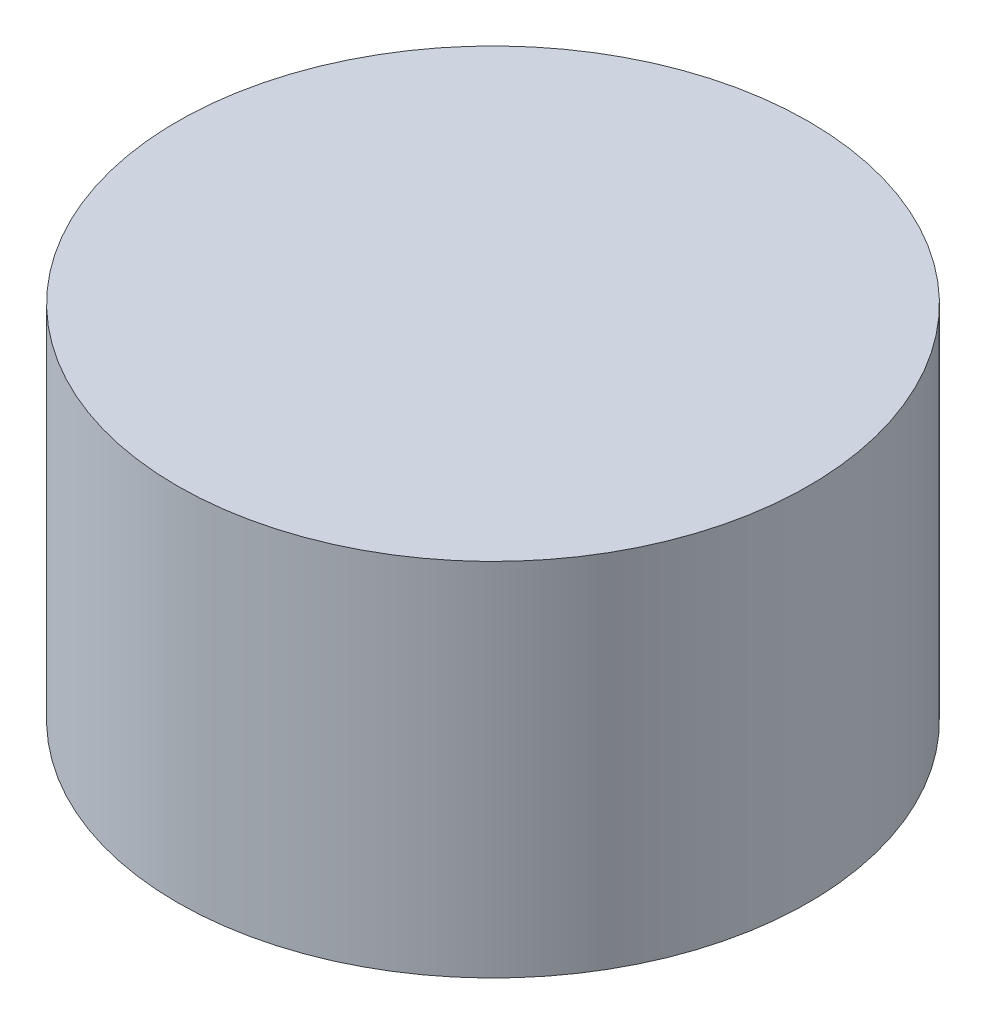
ISO-10303-21;
HEADER;
FILE_DESCRIPTION(('STEP AP214'),'2;1');
FILE_NAME('part.step','',(''),(''),'','','');
FILE_SCHEMA(('AUTOMOTIVE_DESIGN { 1 0 10303 214 1 1 1 1 }'));
ENDSEC;
DATA;
#1=APPLICATION_CONTEXT('core data for automotive mechanical design processes');
#2=APPLICATION_PROTOCOL_DEFINITION('international standard','automotive_design',2000,#1);
#3=PRODUCT_CONTEXT('',#1,'mechanical');
#4=PRODUCT('Part','Part','',(#3));
#5=PRODUCT_RELATED_PRODUCT_CATEGORY('part','',(#4));
#6=PRODUCT_DEFINITION_FORMATION('','',#4);
#7=PRODUCT_DEFINITION_CONTEXT('part definition',#1,'design');
#8=PRODUCT_DEFINITION('design','',#6,#7);
#9=PRODUCT_DEFINITION_SHAPE('','',#8);
#10=(LENGTH_UNIT() NAMED_UNIT(*) SI_UNIT(.MILLI.,.METRE.));
#11=(NAMED_UNIT(*) PLANE_ANGLE_UNIT() SI_UNIT($,.RADIAN.));
#12=(NAMED_UNIT(*) SI_UNIT($,.STERADIAN.) SOLID_ANGLE_UNIT());
#13=UNCERTAINTY_MEASURE_WITH_UNIT(LENGTH_MEASURE(1.E-05),#10,'distance_accuracy_value','');
#14=(GEOMETRIC_REPRESENTATION_CONTEXT(3) GLOBAL_UNCERTAINTY_ASSIGNED_CONTEXT((#13)) GLOBAL_UNIT_ASSIGNED_CONTEXT((#10,
#11,#12)) REPRESENTATION_CONTEXT('',''));
#15=CARTESIAN_POINT('',(0.,0.,0.));
#16=DIRECTION('',(0.,0.,1.));
#17=DIRECTION('',(1.,0.,0.));
#18=AXIS2_PLACEMENT_3D('',#15,#16,#17);
#19=CARTESIAN_POINT('',(0.,2.,0.));
#20=DIRECTION('',(0.,-1.,0.));
#21=DIRECTION('',(0.,0.,-1.));
#22=AXIS2_PLACEMENT_3D('',#19,#20,#21);
#23=CYLINDRICAL_SURFACE('',#22,45.5);
#24=CARTESIAN_POINT('',(0.,2.,0.));
#25=DIRECTION('',(0.,1.,0.));
#26=DIRECTION('',(0.,0.,1.));
#27=AXIS2_PLACEMENT_3D('',#24,#25,#26);
#28=CIRCLE('',#27,45.5);
#29=CARTESIAN_POINT('',(0.,2.,45.5));
#30=VERTEX_POINT('',#29);
#31=EDGE_CURVE('E10',#30,#30,#28,.T.);
#32=ORIENTED_EDGE('',*,*,#31,.F.);
#33=EDGE_LOOP('',(#32));
#34=FACE_BOUND('',#33,.T.);
#35=CARTESIAN_POINT('',(0.,-50.,0.));
#36=DIRECTION('',(0.,-1.,0.));
#37=DIRECTION('',(0.,0.,-1.));
#38=AXIS2_PLACEMENT_3D('',#35,#36,#37);
#39=CIRCLE('',#38,45.5);
#40=CARTESIAN_POINT('',(0.,-50.,-45.5));
#41=VERTEX_POINT('',#40);
#42=EDGE_CURVE('E41',#41,#41,#39,.T.);
#43=ORIENTED_EDGE('',*,*,#42,.F.);
#44=EDGE_LOOP('',(#43));
#45=FACE_BOUND('',#44,.T.);
#46=ADVANCED_FACE('F35',(#34,#45),#23,.T.);
#47=CARTESIAN_POINT('',(0.,2.,0.));
#48=DIRECTION('',(0.,1.,0.));
#49=DIRECTION('',(0.,0.,1.));
#50=AXIS2_PLACEMENT_3D('',#47,#48,#49);
#51=PLANE('',#50);
#52=ORIENTED_EDGE('',*,*,#31,.T.);
#53=EDGE_LOOP('',(#52));
#54=FACE_BOUND('',#53,.T.);
#55=ADVANCED_FACE('F66',(#54),#51,.T.);
#56=CARTESIAN_POINT('',(0.,-50.,0.));
#57=DIRECTION('',(0.,-1.,0.));
#58=DIRECTION('',(0.,0.,-1.));
#59=AXIS2_PLACEMENT_3D('',#56,#57,#58);
#60=PLANE('',#59);
#61=ORIENTED_EDGE('',*,*,#42,.T.);
#62=EDGE_LOOP('',(#61));
#63=FACE_BOUND('',#62,.T.);
#64=CARTESIAN_POINT('',(0.,-50.,0.));
#65=DIRECTION('',(0.,-1.,0.));
#66=DIRECTION('',(0.,0.,-1.));
#67=AXIS2_PLACEMENT_3D('',#64,#65,#66);
#68=CIRCLE('',#67,43.5);
#69=CARTESIAN_POINT('',(0.,-50.,-43.5));
#70=VERTEX_POINT('',#69);
#71=EDGE_CURVE('E45',#70,#70,#68,.T.);
#72=ORIENTED_EDGE('',*,*,#71,.F.);
#73=EDGE_LOOP('',(#72));
#74=FACE_BOUND('',#73,.T.);
#75=ADVANCED_FACE('F59',(#63,#74),#60,.T.);
#76=CARTESIAN_POINT('',(0.,-50.,0.));
#77=DIRECTION('',(0.,1.,0.));
#78=DIRECTION('',(0.,0.,1.));
#79=AXIS2_PLACEMENT_3D('',#76,#77,#78);
#80=CYLINDRICAL_SURFACE('',#79,43.5);
#81=ORIENTED_EDGE('',*,*,#71,.T.);
#82=EDGE_LOOP('',(#81));
#83=FACE_BOUND('',#82,.T.);
#84=CARTESIAN_POINT('',(0.,0.,0.));
#85=DIRECTION('',(0.,-1.,0.));
#86=DIRECTION('',(0.,0.,-1.));
#87=AXIS2_PLACEMENT_3D('',#84,#85,#86);
#88=CIRCLE('',#87,43.5);
#89=CARTESIAN_POINT('',(0.,0.,-43.5));
#90=VERTEX_POINT('',#89);
#91=EDGE_CURVE('E49',#90,#90,#88,.T.);
#92=ORIENTED_EDGE('',*,*,#91,.F.);
#93=EDGE_LOOP('',(#92));
#94=FACE_BOUND('',#93,.T.);
#95=ADVANCED_FACE('F57',(#83,#94),#80,.F.);
#96=CARTESIAN_POINT('',(0.,0.,0.));
#97=DIRECTION('',(0.,1.,0.));
#98=DIRECTION('',(0.,0.,1.));
#99=AXIS2_PLACEMENT_3D('',#96,#97,#98);
#100=PLANE('',#99);
#101=ORIENTED_EDGE('',*,*,#91,.T.);
#102=EDGE_LOOP('',(#101));
#103=FACE_BOUND('',#102,.T.);
#104=ADVANCED_FACE('F55',(#103),#100,.F.);
#105=CLOSED_SHELL('',(#46,#55,#75,#95,#104));
#106=MANIFOLD_SOLID_BREP('B2',#105);
#107=ADVANCED_BREP_SHAPE_REPRESENTATION('',(#18,#106),#14);
#108=SHAPE_DEFINITION_REPRESENTATION(#9,#107);
ENDSEC;
END-ISO-10303-21;
